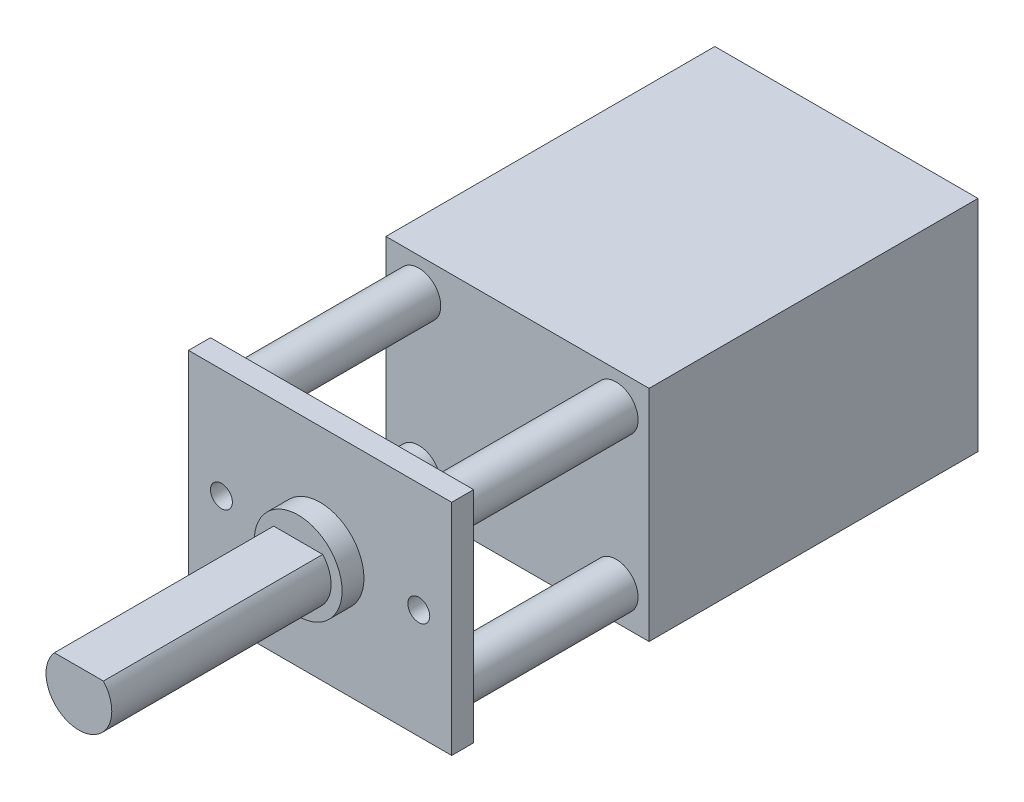
ISO-10303-21;
HEADER;
FILE_DESCRIPTION(('STEP AP214'),'2;1');
FILE_NAME('part.step','',(''),(''),'','','');
FILE_SCHEMA(('AUTOMOTIVE_DESIGN { 1 0 10303 214 1 1 1 1 }'));
ENDSEC;
DATA;
#1=APPLICATION_CONTEXT('core data for automotive mechanical design processes');
#2=APPLICATION_PROTOCOL_DEFINITION('international standard','automotive_design',2000,#1);
#3=PRODUCT_CONTEXT('',#1,'mechanical');
#4=PRODUCT('Part','Part','',(#3));
#5=PRODUCT_RELATED_PRODUCT_CATEGORY('part','',(#4));
#6=PRODUCT_DEFINITION_FORMATION('','',#4);
#7=PRODUCT_DEFINITION_CONTEXT('part definition',#1,'design');
#8=PRODUCT_DEFINITION('design','',#6,#7);
#9=PRODUCT_DEFINITION_SHAPE('','',#8);
#10=(LENGTH_UNIT() NAMED_UNIT(*) SI_UNIT(.MILLI.,.METRE.));
#11=(NAMED_UNIT(*) PLANE_ANGLE_UNIT() SI_UNIT($,.RADIAN.));
#12=(NAMED_UNIT(*) SI_UNIT($,.STERADIAN.) SOLID_ANGLE_UNIT());
#13=UNCERTAINTY_MEASURE_WITH_UNIT(LENGTH_MEASURE(1.E-05),#10,'distance_accuracy_value','');
#14=(GEOMETRIC_REPRESENTATION_CONTEXT(3) GLOBAL_UNCERTAINTY_ASSIGNED_CONTEXT((#13)) GLOBAL_UNIT_ASSIGNED_CONTEXT((#10,
#11,#12)) REPRESENTATION_CONTEXT('',''));
#15=CARTESIAN_POINT('',(0.,0.,0.));
#16=DIRECTION('',(0.,0.,1.));
#17=DIRECTION('',(1.,0.,0.));
#18=AXIS2_PLACEMENT_3D('',#15,#16,#17);
#19=CARTESIAN_POINT('',(6.,5.,1.));
#20=DIRECTION('',(-1.,0.,0.));
#21=DIRECTION('',(0.,-1.,0.));
#22=AXIS2_PLACEMENT_3D('',#19,#20,#21);
#23=PLANE('',#22);
#24=DIRECTION('',(0.,1.,0.));
#25=VECTOR('',#24,1.);
#26=CARTESIAN_POINT('',(6.,5.,0.));
#27=LINE('',#26,#25);
#28=CARTESIAN_POINT('',(6.,-5.,0.));
#29=VERTEX_POINT('',#28);
#30=CARTESIAN_POINT('',(6.,5.,0.));
#31=VERTEX_POINT('',#30);
#32=EDGE_CURVE('E201',#29,#31,#27,.T.);
#33=ORIENTED_EDGE('',*,*,#32,.T.);
#34=DIRECTION('',(0.,0.,-1.));
#35=VECTOR('',#34,1.);
#36=CARTESIAN_POINT('',(6.,5.,1.));
#37=LINE('',#36,#35);
#38=CARTESIAN_POINT('',(6.,5.,1.));
#39=VERTEX_POINT('',#38);
#40=EDGE_CURVE('E233',#39,#31,#37,.T.);
#41=ORIENTED_EDGE('',*,*,#40,.F.);
#42=DIRECTION('',(0.,1.,0.));
#43=VECTOR('',#42,1.);
#44=CARTESIAN_POINT('',(6.,5.,1.));
#45=LINE('',#44,#43);
#46=CARTESIAN_POINT('',(6.,-5.,1.));
#47=VERTEX_POINT('',#46);
#48=EDGE_CURVE('E202',#47,#39,#45,.T.);
#49=ORIENTED_EDGE('',*,*,#48,.F.);
#50=DIRECTION('',(0.,0.,-1.));
#51=VECTOR('',#50,1.);
#52=CARTESIAN_POINT('',(6.,-5.,1.));
#53=LINE('',#52,#51);
#54=EDGE_CURVE('E212',#47,#29,#53,.T.);
#55=ORIENTED_EDGE('',*,*,#54,.T.);
#56=EDGE_LOOP('',(#33,#41,#49,#55));
#57=FACE_BOUND('',#56,.T.);
#58=ADVANCED_FACE('F39',(#57),#23,.F.);
#59=CARTESIAN_POINT('',(-6.,5.,1.));
#60=DIRECTION('',(0.,-1.,0.));
#61=DIRECTION('',(0.,0.,-1.));
#62=AXIS2_PLACEMENT_3D('',#59,#60,#61);
#63=PLANE('',#62);
#64=DIRECTION('',(-1.,0.,0.));
#65=VECTOR('',#64,1.);
#66=CARTESIAN_POINT('',(-6.,5.,0.));
#67=LINE('',#66,#65);
#68=CARTESIAN_POINT('',(-6.,5.,0.));
#69=VERTEX_POINT('',#68);
#70=EDGE_CURVE('E216',#31,#69,#67,.T.);
#71=ORIENTED_EDGE('',*,*,#70,.T.);
#72=DIRECTION('',(0.,0.,-1.));
#73=VECTOR('',#72,1.);
#74=CARTESIAN_POINT('',(-6.,5.,1.));
#75=LINE('',#74,#73);
#76=CARTESIAN_POINT('',(-6.,5.,1.));
#77=VERTEX_POINT('',#76);
#78=EDGE_CURVE('E229',#77,#69,#75,.T.);
#79=ORIENTED_EDGE('',*,*,#78,.F.);
#80=DIRECTION('',(-1.,0.,0.));
#81=VECTOR('',#80,1.);
#82=CARTESIAN_POINT('',(-6.,5.,1.));
#83=LINE('',#82,#81);
#84=EDGE_CURVE('E92',#39,#77,#83,.T.);
#85=ORIENTED_EDGE('',*,*,#84,.F.);
#86=ORIENTED_EDGE('',*,*,#40,.T.);
#87=EDGE_LOOP('',(#71,#79,#85,#86));
#88=FACE_BOUND('',#87,.T.);
#89=ADVANCED_FACE('F276',(#88),#63,.F.);
#90=CARTESIAN_POINT('',(-6.,5.,1.));
#91=DIRECTION('',(1.,0.,0.));
#92=DIRECTION('',(0.,0.,-1.));
#93=AXIS2_PLACEMENT_3D('',#90,#91,#92);
#94=PLANE('',#93);
#95=DIRECTION('',(0.,-1.,0.));
#96=VECTOR('',#95,1.);
#97=CARTESIAN_POINT('',(-6.,5.,0.));
#98=LINE('',#97,#96);
#99=CARTESIAN_POINT('',(-6.,-5.,0.));
#100=VERTEX_POINT('',#99);
#101=EDGE_CURVE('E219',#69,#100,#98,.T.);
#102=ORIENTED_EDGE('',*,*,#101,.T.);
#103=DIRECTION('',(0.,0.,-1.));
#104=VECTOR('',#103,1.);
#105=CARTESIAN_POINT('',(-6.,-5.,1.));
#106=LINE('',#105,#104);
#107=CARTESIAN_POINT('',(-6.,-5.,1.));
#108=VERTEX_POINT('',#107);
#109=EDGE_CURVE('E226',#108,#100,#106,.T.);
#110=ORIENTED_EDGE('',*,*,#109,.F.);
#111=DIRECTION('',(0.,-1.,0.));
#112=VECTOR('',#111,1.);
#113=CARTESIAN_POINT('',(-6.,5.,1.));
#114=LINE('',#113,#112);
#115=EDGE_CURVE('E207',#77,#108,#114,.T.);
#116=ORIENTED_EDGE('',*,*,#115,.F.);
#117=ORIENTED_EDGE('',*,*,#78,.T.);
#118=EDGE_LOOP('',(#102,#110,#116,#117));
#119=FACE_BOUND('',#118,.T.);
#120=ADVANCED_FACE('F275',(#119),#94,.F.);
#121=CARTESIAN_POINT('',(-6.,-5.,1.));
#122=DIRECTION('',(0.,1.,0.));
#123=DIRECTION('',(0.,0.,1.));
#124=AXIS2_PLACEMENT_3D('',#121,#122,#123);
#125=PLANE('',#124);
#126=DIRECTION('',(1.,0.,0.));
#127=VECTOR('',#126,1.);
#128=CARTESIAN_POINT('',(-6.,-5.,0.));
#129=LINE('',#128,#127);
#130=EDGE_CURVE('E84',#100,#29,#129,.T.);
#131=ORIENTED_EDGE('',*,*,#130,.T.);
#132=ORIENTED_EDGE('',*,*,#54,.F.);
#133=DIRECTION('',(1.,0.,0.));
#134=VECTOR('',#133,1.);
#135=CARTESIAN_POINT('',(-6.,-5.,1.));
#136=LINE('',#135,#134);
#137=EDGE_CURVE('E63',#108,#47,#136,.T.);
#138=ORIENTED_EDGE('',*,*,#137,.F.);
#139=ORIENTED_EDGE('',*,*,#109,.T.);
#140=EDGE_LOOP('',(#131,#132,#138,#139));
#141=FACE_BOUND('',#140,.T.);
#142=ADVANCED_FACE('F271',(#141),#125,.F.);
#143=CARTESIAN_POINT('',(0.,0.,1.));
#144=DIRECTION('',(0.,0.,1.));
#145=DIRECTION('',(1.,0.,0.));
#146=AXIS2_PLACEMENT_3D('',#143,#144,#145);
#147=PLANE('',#146);
#148=CARTESIAN_POINT('',(4.5,0.,0.999999999999999));
#149=DIRECTION('',(0.,0.,1.));
#150=DIRECTION('',(1.,0.,0.));
#151=AXIS2_PLACEMENT_3D('',#148,#149,#150);
#152=CIRCLE('',#151,0.5);
#153=CARTESIAN_POINT('',(5.,0.,0.999999999999999));
#154=VERTEX_POINT('',#153);
#155=EDGE_CURVE('E352',#154,#154,#152,.F.);
#156=ORIENTED_EDGE('',*,*,#155,.T.);
#157=EDGE_LOOP('',(#156));
#158=FACE_BOUND('',#157,.T.);
#159=CARTESIAN_POINT('',(-4.5,0.,0.999999999999999));
#160=DIRECTION('',(0.,0.,1.));
#161=DIRECTION('',(1.,0.,0.));
#162=AXIS2_PLACEMENT_3D('',#159,#160,#161);
#163=CIRCLE('',#162,0.500000000000001);
#164=CARTESIAN_POINT('',(-4.,0.,0.999999999999999));
#165=VERTEX_POINT('',#164);
#166=EDGE_CURVE('E368',#165,#165,#163,.F.);
#167=ORIENTED_EDGE('',*,*,#166,.T.);
#168=EDGE_LOOP('',(#167));
#169=FACE_BOUND('',#168,.T.);
#170=CARTESIAN_POINT('',(0.,0.,1.));
#171=DIRECTION('',(0.,0.,1.));
#172=DIRECTION('',(1.,0.,0.));
#173=AXIS2_PLACEMENT_3D('',#170,#171,#172);
#174=CIRCLE('',#173,2.);
#175=CARTESIAN_POINT('',(2.,0.,1.));
#176=VERTEX_POINT('',#175);
#177=EDGE_CURVE('E11',#176,#176,#174,.T.);
#178=ORIENTED_EDGE('',*,*,#177,.F.);
#179=EDGE_LOOP('',(#178));
#180=FACE_BOUND('',#179,.T.);
#181=ORIENTED_EDGE('',*,*,#48,.T.);
#182=ORIENTED_EDGE('',*,*,#84,.T.);
#183=ORIENTED_EDGE('',*,*,#115,.T.);
#184=ORIENTED_EDGE('',*,*,#137,.T.);
#185=EDGE_LOOP('',(#181,#182,#183,#184));
#186=FACE_BOUND('',#185,.T.);
#187=ADVANCED_FACE('F258',(#158,#169,#180,#186),#147,.T.);
#188=CARTESIAN_POINT('',(0.,0.,0.));
#189=DIRECTION('',(0.,0.,1.));
#190=DIRECTION('',(1.,0.,0.));
#191=AXIS2_PLACEMENT_3D('',#188,#189,#190);
#192=PLANE('',#191);
#193=CARTESIAN_POINT('',(4.5,0.,0.));
#194=DIRECTION('',(0.,0.,-1.));
#195=DIRECTION('',(-1.,0.,0.));
#196=AXIS2_PLACEMENT_3D('',#193,#194,#195);
#197=CIRCLE('',#196,0.5);
#198=CARTESIAN_POINT('',(4.,0.,0.));
#199=VERTEX_POINT('',#198);
#200=EDGE_CURVE('E355',#199,#199,#197,.T.);
#201=ORIENTED_EDGE('',*,*,#200,.F.);
#202=EDGE_LOOP('',(#201));
#203=FACE_BOUND('',#202,.T.);
#204=CARTESIAN_POINT('',(-4.5,0.,0.));
#205=DIRECTION('',(0.,0.,-1.));
#206=DIRECTION('',(1.,0.,0.));
#207=AXIS2_PLACEMENT_3D('',#204,#205,#206);
#208=CIRCLE('',#207,0.500000000000001);
#209=CARTESIAN_POINT('',(-4.,0.,0.));
#210=VERTEX_POINT('',#209);
#211=EDGE_CURVE('E362',#210,#210,#208,.T.);
#212=ORIENTED_EDGE('',*,*,#211,.F.);
#213=EDGE_LOOP('',(#212));
#214=FACE_BOUND('',#213,.T.);
#215=CARTESIAN_POINT('',(4.5,-3.5,0.));
#216=DIRECTION('',(0.,0.,1.));
#217=DIRECTION('',(1.,0.,0.));
#218=AXIS2_PLACEMENT_3D('',#215,#216,#217);
#219=CIRCLE('',#218,1.);
#220=CARTESIAN_POINT('',(5.5,-3.5,0.));
#221=VERTEX_POINT('',#220);
#222=EDGE_CURVE('E42',#221,#221,#219,.F.);
#223=ORIENTED_EDGE('',*,*,#222,.F.);
#224=EDGE_LOOP('',(#223));
#225=FACE_BOUND('',#224,.T.);
#226=CARTESIAN_POINT('',(-4.49999999999998,-3.50000000000003,0.));
#227=DIRECTION('',(0.,0.,1.));
#228=DIRECTION('',(1.,0.,0.));
#229=AXIS2_PLACEMENT_3D('',#226,#227,#228);
#230=CIRCLE('',#229,1.);
#231=CARTESIAN_POINT('',(-3.49999999999998,-3.50000000000003,0.));
#232=VERTEX_POINT('',#231);
#233=EDGE_CURVE('E243',#232,#232,#230,.F.);
#234=ORIENTED_EDGE('',*,*,#233,.F.);
#235=EDGE_LOOP('',(#234));
#236=FACE_BOUND('',#235,.T.);
#237=CARTESIAN_POINT('',(-4.49999999999998,3.50000000000003,0.));
#238=DIRECTION('',(0.,0.,1.));
#239=DIRECTION('',(1.,0.,0.));
#240=AXIS2_PLACEMENT_3D('',#237,#238,#239);
#241=CIRCLE('',#240,1.);
#242=CARTESIAN_POINT('',(-3.49999999999998,3.50000000000003,0.));
#243=VERTEX_POINT('',#242);
#244=EDGE_CURVE('E240',#243,#243,#241,.F.);
#245=ORIENTED_EDGE('',*,*,#244,.F.);
#246=EDGE_LOOP('',(#245));
#247=FACE_BOUND('',#246,.T.);
#248=CARTESIAN_POINT('',(4.5,3.5,0.));
#249=DIRECTION('',(0.,0.,1.));
#250=DIRECTION('',(1.,0.,0.));
#251=AXIS2_PLACEMENT_3D('',#248,#249,#250);
#252=CIRCLE('',#251,1.);
#253=CARTESIAN_POINT('',(5.5,3.5,0.));
#254=VERTEX_POINT('',#253);
#255=EDGE_CURVE('E236',#254,#254,#252,.F.);
#256=ORIENTED_EDGE('',*,*,#255,.F.);
#257=EDGE_LOOP('',(#256));
#258=FACE_BOUND('',#257,.T.);
#259=ORIENTED_EDGE('',*,*,#32,.F.);
#260=ORIENTED_EDGE('',*,*,#130,.F.);
#261=ORIENTED_EDGE('',*,*,#101,.F.);
#262=ORIENTED_EDGE('',*,*,#70,.F.);
#263=EDGE_LOOP('',(#259,#260,#261,#262));
#264=FACE_BOUND('',#263,.T.);
#265=ADVANCED_FACE('F254',(#203,#214,#225,#236,#247,#258,#264),#192,.F.);
#266=CARTESIAN_POINT('',(4.5,3.5,-8.));
#267=DIRECTION('',(0.,0.,1.));
#268=DIRECTION('',(1.,0.,0.));
#269=AXIS2_PLACEMENT_3D('',#266,#267,#268);
#270=CYLINDRICAL_SURFACE('',#269,1.);
#271=CARTESIAN_POINT('',(4.5,3.5,-8.));
#272=DIRECTION('',(0.,0.,-1.));
#273=DIRECTION('',(-1.,0.,0.));
#274=AXIS2_PLACEMENT_3D('',#271,#272,#273);
#275=CIRCLE('',#274,1.);
#276=CARTESIAN_POINT('',(3.5,3.5,-8.));
#277=VERTEX_POINT('',#276);
#278=EDGE_CURVE('E197',#277,#277,#275,.T.);
#279=ORIENTED_EDGE('',*,*,#278,.F.);
#280=EDGE_LOOP('',(#279));
#281=FACE_BOUND('',#280,.T.);
#282=ORIENTED_EDGE('',*,*,#255,.T.);
#283=EDGE_LOOP('',(#282));
#284=FACE_BOUND('',#283,.T.);
#285=ADVANCED_FACE('F257',(#281,#284),#270,.T.);
#286=CARTESIAN_POINT('',(-4.49999999999998,3.50000000000003,-8.));
#287=DIRECTION('',(0.,0.,1.));
#288=DIRECTION('',(1.,0.,0.));
#289=AXIS2_PLACEMENT_3D('',#286,#287,#288);
#290=CYLINDRICAL_SURFACE('',#289,1.);
#291=CARTESIAN_POINT('',(-4.49999999999998,3.50000000000003,-8.));
#292=DIRECTION('',(0.,0.,-1.));
#293=DIRECTION('',(1.,0.,0.));
#294=AXIS2_PLACEMENT_3D('',#291,#292,#293);
#295=CIRCLE('',#294,1.);
#296=CARTESIAN_POINT('',(-3.49999999999998,3.50000000000003,-8.));
#297=VERTEX_POINT('',#296);
#298=EDGE_CURVE('E193',#297,#297,#295,.T.);
#299=ORIENTED_EDGE('',*,*,#298,.F.);
#300=EDGE_LOOP('',(#299));
#301=FACE_BOUND('',#300,.T.);
#302=ORIENTED_EDGE('',*,*,#244,.T.);
#303=EDGE_LOOP('',(#302));
#304=FACE_BOUND('',#303,.T.);
#305=ADVANCED_FACE('F291',(#301,#304),#290,.T.);
#306=CARTESIAN_POINT('',(-4.49999999999998,-3.50000000000003,-8.));
#307=DIRECTION('',(0.,0.,1.));
#308=DIRECTION('',(1.,0.,0.));
#309=AXIS2_PLACEMENT_3D('',#306,#307,#308);
#310=CYLINDRICAL_SURFACE('',#309,1.);
#311=CARTESIAN_POINT('',(-4.49999999999998,-3.50000000000003,-8.));
#312=DIRECTION('',(0.,0.,-1.));
#313=DIRECTION('',(-1.,0.,0.));
#314=AXIS2_PLACEMENT_3D('',#311,#312,#313);
#315=CIRCLE('',#314,1.);
#316=CARTESIAN_POINT('',(-5.49999999999998,-3.50000000000003,-8.));
#317=VERTEX_POINT('',#316);
#318=EDGE_CURVE('E189',#317,#317,#315,.T.);
#319=ORIENTED_EDGE('',*,*,#318,.F.);
#320=EDGE_LOOP('',(#319));
#321=FACE_BOUND('',#320,.T.);
#322=ORIENTED_EDGE('',*,*,#233,.T.);
#323=EDGE_LOOP('',(#322));
#324=FACE_BOUND('',#323,.T.);
#325=ADVANCED_FACE('F295',(#321,#324),#310,.T.);
#326=CARTESIAN_POINT('',(4.5,-3.5,-8.));
#327=DIRECTION('',(0.,0.,1.));
#328=DIRECTION('',(1.,0.,0.));
#329=AXIS2_PLACEMENT_3D('',#326,#327,#328);
#330=CYLINDRICAL_SURFACE('',#329,1.);
#331=CARTESIAN_POINT('',(4.5,-3.5,-8.));
#332=DIRECTION('',(0.,0.,-1.));
#333=DIRECTION('',(1.,0.,0.));
#334=AXIS2_PLACEMENT_3D('',#331,#332,#333);
#335=CIRCLE('',#334,1.);
#336=CARTESIAN_POINT('',(5.5,-3.5,-8.));
#337=VERTEX_POINT('',#336);
#338=EDGE_CURVE('E184',#337,#337,#335,.T.);
#339=ORIENTED_EDGE('',*,*,#338,.F.);
#340=EDGE_LOOP('',(#339));
#341=FACE_BOUND('',#340,.T.);
#342=ORIENTED_EDGE('',*,*,#222,.T.);
#343=EDGE_LOOP('',(#342));
#344=FACE_BOUND('',#343,.T.);
#345=ADVANCED_FACE('F252',(#341,#344),#330,.T.);
#346=CARTESIAN_POINT('',(0.,0.,2.));
#347=DIRECTION('',(0.,0.,-1.));
#348=DIRECTION('',(-1.,0.,0.));
#349=AXIS2_PLACEMENT_3D('',#346,#347,#348);
#350=CYLINDRICAL_SURFACE('',#349,2.);
#351=CARTESIAN_POINT('',(0.,0.,2.));
#352=DIRECTION('',(0.,0.,1.));
#353=DIRECTION('',(1.,0.,0.));
#354=AXIS2_PLACEMENT_3D('',#351,#352,#353);
#355=CIRCLE('',#354,2.);
#356=CARTESIAN_POINT('',(2.,0.,2.));
#357=VERTEX_POINT('',#356);
#358=EDGE_CURVE('E181',#357,#357,#355,.T.);
#359=ORIENTED_EDGE('',*,*,#358,.F.);
#360=EDGE_LOOP('',(#359));
#361=FACE_BOUND('',#360,.T.);
#362=ORIENTED_EDGE('',*,*,#177,.T.);
#363=EDGE_LOOP('',(#362));
#364=FACE_BOUND('',#363,.T.);
#365=ADVANCED_FACE('F302',(#361,#364),#350,.T.);
#366=CARTESIAN_POINT('',(0.,0.,2.));
#367=DIRECTION('',(0.,0.,1.));
#368=DIRECTION('',(1.,0.,0.));
#369=AXIS2_PLACEMENT_3D('',#366,#367,#368);
#370=PLANE('',#369);
#371=CARTESIAN_POINT('',(0.,0.,2.));
#372=DIRECTION('',(0.,0.,1.));
#373=DIRECTION('',(1.,0.,0.));
#374=AXIS2_PLACEMENT_3D('',#371,#372,#373);
#375=CIRCLE('',#374,1.5);
#376=CARTESIAN_POINT('',(-1.11803398874989,1.,2.));
#377=VERTEX_POINT('',#376);
#378=CARTESIAN_POINT('',(1.11803398874989,1.,2.));
#379=VERTEX_POINT('',#378);
#380=EDGE_CURVE('E155',#377,#379,#375,.T.);
#381=ORIENTED_EDGE('',*,*,#380,.F.);
#382=DIRECTION('',(-1.,0.,0.));
#383=VECTOR('',#382,1.);
#384=CARTESIAN_POINT('',(-1.11803398874989,1.,2.));
#385=LINE('',#384,#383);
#386=EDGE_CURVE('E54',#379,#377,#385,.T.);
#387=ORIENTED_EDGE('',*,*,#386,.F.);
#388=EDGE_LOOP('',(#381,#387));
#389=FACE_BOUND('',#388,.T.);
#390=ORIENTED_EDGE('',*,*,#358,.T.);
#391=EDGE_LOOP('',(#390));
#392=FACE_BOUND('',#391,.T.);
#393=ADVANCED_FACE('F306',(#389,#392),#370,.T.);
#394=CARTESIAN_POINT('',(0.,0.,12.));
#395=DIRECTION('',(0.,0.,-1.));
#396=DIRECTION('',(-1.,0.,0.));
#397=AXIS2_PLACEMENT_3D('',#394,#395,#396);
#398=CYLINDRICAL_SURFACE('',#397,1.5);
#399=ORIENTED_EDGE('',*,*,#380,.T.);
#400=DIRECTION('',(0.,0.,-1.));
#401=VECTOR('',#400,1.);
#402=CARTESIAN_POINT('',(1.11803398874989,1.,12.));
#403=LINE('',#402,#401);
#404=CARTESIAN_POINT('',(1.11803398874989,1.,12.));
#405=VERTEX_POINT('',#404);
#406=EDGE_CURVE('E178',#405,#379,#403,.T.);
#407=ORIENTED_EDGE('',*,*,#406,.F.);
#408=CARTESIAN_POINT('',(0.,0.,12.));
#409=DIRECTION('',(0.,0.,1.));
#410=DIRECTION('',(1.,0.,0.));
#411=AXIS2_PLACEMENT_3D('',#408,#409,#410);
#412=CIRCLE('',#411,1.5);
#413=CARTESIAN_POINT('',(-1.11803398874989,1.,12.));
#414=VERTEX_POINT('',#413);
#415=EDGE_CURVE('E165',#414,#405,#412,.T.);
#416=ORIENTED_EDGE('',*,*,#415,.F.);
#417=DIRECTION('',(0.,0.,-1.));
#418=VECTOR('',#417,1.);
#419=CARTESIAN_POINT('',(-1.11803398874989,1.,12.));
#420=LINE('',#419,#418);
#421=EDGE_CURVE('E171',#414,#377,#420,.T.);
#422=ORIENTED_EDGE('',*,*,#421,.T.);
#423=EDGE_LOOP('',(#399,#407,#416,#422));
#424=FACE_BOUND('',#423,.T.);
#425=ADVANCED_FACE('F310',(#424),#398,.T.);
#426=CARTESIAN_POINT('',(-1.11803398874989,1.,12.));
#427=DIRECTION('',(0.,-1.,0.));
#428=DIRECTION('',(0.,0.,-1.));
#429=AXIS2_PLACEMENT_3D('',#426,#427,#428);
#430=PLANE('',#429);
#431=ORIENTED_EDGE('',*,*,#386,.T.);
#432=ORIENTED_EDGE('',*,*,#421,.F.);
#433=DIRECTION('',(-1.,0.,0.));
#434=VECTOR('',#433,1.);
#435=CARTESIAN_POINT('',(-1.11803398874989,1.,12.));
#436=LINE('',#435,#434);
#437=EDGE_CURVE('E169',#405,#414,#436,.T.);
#438=ORIENTED_EDGE('',*,*,#437,.F.);
#439=ORIENTED_EDGE('',*,*,#406,.T.);
#440=EDGE_LOOP('',(#431,#432,#438,#439));
#441=FACE_BOUND('',#440,.T.);
#442=ADVANCED_FACE('F313',(#441),#430,.F.);
#443=CARTESIAN_POINT('',(0.,0.,12.));
#444=DIRECTION('',(0.,0.,1.));
#445=DIRECTION('',(1.,0.,0.));
#446=AXIS2_PLACEMENT_3D('',#443,#444,#445);
#447=PLANE('',#446);
#448=ORIENTED_EDGE('',*,*,#415,.T.);
#449=ORIENTED_EDGE('',*,*,#437,.T.);
#450=EDGE_LOOP('',(#448,#449));
#451=FACE_BOUND('',#450,.T.);
#452=ADVANCED_FACE('F317',(#451),#447,.T.);
#453=CARTESIAN_POINT('',(6.,5.,-23.));
#454=DIRECTION('',(-1.,0.,0.));
#455=DIRECTION('',(0.,0.,1.));
#456=AXIS2_PLACEMENT_3D('',#453,#454,#455);
#457=PLANE('',#456);
#458=DIRECTION('',(0.,-1.,0.));
#459=VECTOR('',#458,1.);
#460=CARTESIAN_POINT('',(6.,5.,-8.));
#461=LINE('',#460,#459);
#462=CARTESIAN_POINT('',(6.,5.,-8.));
#463=VERTEX_POINT('',#462);
#464=CARTESIAN_POINT('',(6.,-5.,-8.));
#465=VERTEX_POINT('',#464);
#466=EDGE_CURVE('E153',#463,#465,#461,.T.);
#467=ORIENTED_EDGE('',*,*,#466,.T.);
#468=DIRECTION('',(0.,0.,1.));
#469=VECTOR('',#468,1.);
#470=CARTESIAN_POINT('',(6.,-5.,-23.));
#471=LINE('',#470,#469);
#472=CARTESIAN_POINT('',(6.,-5.,-23.));
#473=VERTEX_POINT('',#472);
#474=EDGE_CURVE('E131',#473,#465,#471,.T.);
#475=ORIENTED_EDGE('',*,*,#474,.F.);
#476=DIRECTION('',(0.,-1.,0.));
#477=VECTOR('',#476,1.);
#478=CARTESIAN_POINT('',(6.,5.,-23.));
#479=LINE('',#478,#477);
#480=CARTESIAN_POINT('',(6.,5.,-23.));
#481=VERTEX_POINT('',#480);
#482=EDGE_CURVE('E139',#481,#473,#479,.T.);
#483=ORIENTED_EDGE('',*,*,#482,.F.);
#484=DIRECTION('',(0.,0.,1.));
#485=VECTOR('',#484,1.);
#486=CARTESIAN_POINT('',(6.,5.,-23.));
#487=LINE('',#486,#485);
#488=EDGE_CURVE('E375',#481,#463,#487,.T.);
#489=ORIENTED_EDGE('',*,*,#488,.T.);
#490=EDGE_LOOP('',(#467,#475,#483,#489));
#491=FACE_BOUND('',#490,.T.);
#492=ADVANCED_FACE('F151',(#491),#457,.F.);
#493=CARTESIAN_POINT('',(6.,-5.,-23.));
#494=DIRECTION('',(0.,1.,0.));
#495=DIRECTION('',(0.,0.,1.));
#496=AXIS2_PLACEMENT_3D('',#493,#494,#495);
#497=PLANE('',#496);
#498=DIRECTION('',(-1.,0.,0.));
#499=VECTOR('',#498,1.);
#500=CARTESIAN_POINT('',(6.,-5.,-8.));
#501=LINE('',#500,#499);
#502=CARTESIAN_POINT('',(-6.,-5.,-8.));
#503=VERTEX_POINT('',#502);
#504=EDGE_CURVE('E360',#465,#503,#501,.T.);
#505=ORIENTED_EDGE('',*,*,#504,.T.);
#506=DIRECTION('',(0.,0.,1.));
#507=VECTOR('',#506,1.);
#508=CARTESIAN_POINT('',(-6.,-5.,-23.));
#509=LINE('',#508,#507);
#510=CARTESIAN_POINT('',(-6.,-5.,-23.));
#511=VERTEX_POINT('',#510);
#512=EDGE_CURVE('E134',#511,#503,#509,.T.);
#513=ORIENTED_EDGE('',*,*,#512,.F.);
#514=DIRECTION('',(-1.,0.,0.));
#515=VECTOR('',#514,1.);
#516=CARTESIAN_POINT('',(6.,-5.,-23.));
#517=LINE('',#516,#515);
#518=EDGE_CURVE('E127',#473,#511,#517,.T.);
#519=ORIENTED_EDGE('',*,*,#518,.F.);
#520=ORIENTED_EDGE('',*,*,#474,.T.);
#521=EDGE_LOOP('',(#505,#513,#519,#520));
#522=FACE_BOUND('',#521,.T.);
#523=ADVANCED_FACE('F129',(#522),#497,.F.);
#524=CARTESIAN_POINT('',(-6.,5.,-23.));
#525=DIRECTION('',(1.,0.,0.));
#526=DIRECTION('',(0.,0.,-1.));
#527=AXIS2_PLACEMENT_3D('',#524,#525,#526);
#528=PLANE('',#527);
#529=DIRECTION('',(0.,1.,0.));
#530=VECTOR('',#529,1.);
#531=CARTESIAN_POINT('',(-6.,5.,-8.));
#532=LINE('',#531,#530);
#533=CARTESIAN_POINT('',(-6.,5.,-8.));
#534=VERTEX_POINT('',#533);
#535=EDGE_CURVE('E379',#503,#534,#532,.T.);
#536=ORIENTED_EDGE('',*,*,#535,.T.);
#537=DIRECTION('',(0.,0.,1.));
#538=VECTOR('',#537,1.);
#539=CARTESIAN_POINT('',(-6.,5.,-23.));
#540=LINE('',#539,#538);
#541=CARTESIAN_POINT('',(-6.,5.,-23.));
#542=VERTEX_POINT('',#541);
#543=EDGE_CURVE('E161',#542,#534,#540,.T.);
#544=ORIENTED_EDGE('',*,*,#543,.F.);
#545=DIRECTION('',(0.,1.,0.));
#546=VECTOR('',#545,1.);
#547=CARTESIAN_POINT('',(-6.,5.,-23.));
#548=LINE('',#547,#546);
#549=EDGE_CURVE('E138',#511,#542,#548,.T.);
#550=ORIENTED_EDGE('',*,*,#549,.F.);
#551=ORIENTED_EDGE('',*,*,#512,.T.);
#552=EDGE_LOOP('',(#536,#544,#550,#551));
#553=FACE_BOUND('',#552,.T.);
#554=ADVANCED_FACE('F326',(#553),#528,.F.);
#555=CARTESIAN_POINT('',(6.,5.,-23.));
#556=DIRECTION('',(0.,-1.,0.));
#557=DIRECTION('',(0.,0.,-1.));
#558=AXIS2_PLACEMENT_3D('',#555,#556,#557);
#559=PLANE('',#558);
#560=DIRECTION('',(1.,0.,0.));
#561=VECTOR('',#560,1.);
#562=CARTESIAN_POINT('',(6.,5.,-8.));
#563=LINE('',#562,#561);
#564=EDGE_CURVE('E149',#534,#463,#563,.T.);
#565=ORIENTED_EDGE('',*,*,#564,.T.);
#566=ORIENTED_EDGE('',*,*,#488,.F.);
#567=DIRECTION('',(1.,0.,0.));
#568=VECTOR('',#567,1.);
#569=CARTESIAN_POINT('',(6.,5.,-23.));
#570=LINE('',#569,#568);
#571=EDGE_CURVE('E144',#542,#481,#570,.T.);
#572=ORIENTED_EDGE('',*,*,#571,.F.);
#573=ORIENTED_EDGE('',*,*,#543,.T.);
#574=EDGE_LOOP('',(#565,#566,#572,#573));
#575=FACE_BOUND('',#574,.T.);
#576=ADVANCED_FACE('F329',(#575),#559,.F.);
#577=CARTESIAN_POINT('',(0.,0.,-23.));
#578=DIRECTION('',(0.,0.,-1.));
#579=DIRECTION('',(-1.,0.,0.));
#580=AXIS2_PLACEMENT_3D('',#577,#578,#579);
#581=PLANE('',#580);
#582=ORIENTED_EDGE('',*,*,#482,.T.);
#583=ORIENTED_EDGE('',*,*,#518,.T.);
#584=ORIENTED_EDGE('',*,*,#549,.T.);
#585=ORIENTED_EDGE('',*,*,#571,.T.);
#586=EDGE_LOOP('',(#582,#583,#584,#585));
#587=FACE_BOUND('',#586,.T.);
#588=ADVANCED_FACE('F142',(#587),#581,.T.);
#589=CARTESIAN_POINT('',(0.,0.,-8.));
#590=DIRECTION('',(0.,0.,-1.));
#591=DIRECTION('',(-1.,0.,0.));
#592=AXIS2_PLACEMENT_3D('',#589,#590,#591);
#593=PLANE('',#592);
#594=ORIENTED_EDGE('',*,*,#278,.T.);
#595=EDGE_LOOP('',(#594));
#596=FACE_BOUND('',#595,.T.);
#597=ORIENTED_EDGE('',*,*,#298,.T.);
#598=EDGE_LOOP('',(#597));
#599=FACE_BOUND('',#598,.T.);
#600=ORIENTED_EDGE('',*,*,#318,.T.);
#601=EDGE_LOOP('',(#600));
#602=FACE_BOUND('',#601,.T.);
#603=ORIENTED_EDGE('',*,*,#338,.T.);
#604=EDGE_LOOP('',(#603));
#605=FACE_BOUND('',#604,.T.);
#606=ORIENTED_EDGE('',*,*,#466,.F.);
#607=ORIENTED_EDGE('',*,*,#564,.F.);
#608=ORIENTED_EDGE('',*,*,#535,.F.);
#609=ORIENTED_EDGE('',*,*,#504,.F.);
#610=EDGE_LOOP('',(#606,#607,#608,#609));
#611=FACE_BOUND('',#610,.T.);
#612=ADVANCED_FACE('F334',(#596,#599,#602,#605,#611),#593,.F.);
#613=CARTESIAN_POINT('',(-4.5,0.,12.001));
#614=DIRECTION('',(0.,0.,-1.));
#615=DIRECTION('',(-1.,0.,0.));
#616=AXIS2_PLACEMENT_3D('',#613,#614,#615);
#617=CYLINDRICAL_SURFACE('',#616,0.500000000000001);
#618=ORIENTED_EDGE('',*,*,#166,.F.);
#619=EDGE_LOOP('',(#618));
#620=FACE_BOUND('',#619,.T.);
#621=ORIENTED_EDGE('',*,*,#211,.T.);
#622=EDGE_LOOP('',(#621));
#623=FACE_BOUND('',#622,.T.);
#624=ADVANCED_FACE('F337',(#620,#623),#617,.F.);
#625=CARTESIAN_POINT('',(4.5,0.,12.001));
#626=DIRECTION('',(0.,0.,-1.));
#627=DIRECTION('',(-1.,0.,0.));
#628=AXIS2_PLACEMENT_3D('',#625,#626,#627);
#629=CYLINDRICAL_SURFACE('',#628,0.5);
#630=ORIENTED_EDGE('',*,*,#155,.F.);
#631=EDGE_LOOP('',(#630));
#632=FACE_BOUND('',#631,.T.);
#633=ORIENTED_EDGE('',*,*,#200,.T.);
#634=EDGE_LOOP('',(#633));
#635=FACE_BOUND('',#634,.T.);
#636=ADVANCED_FACE('F343',(#632,#635),#629,.F.);
#637=CLOSED_SHELL('',(#58,#89,#120,#142,#187,#265,#285,#305,#325,#345,#365,#393,#425,#442,#452,
#492,#523,#554,#576,#588,#612,#624,#636));
#638=MANIFOLD_SOLID_BREP('B2',#637);
#639=ADVANCED_BREP_SHAPE_REPRESENTATION('',(#18,#638),#14);
#640=SHAPE_DEFINITION_REPRESENTATION(#9,#639);
ENDSEC;
END-ISO-10303-21;
